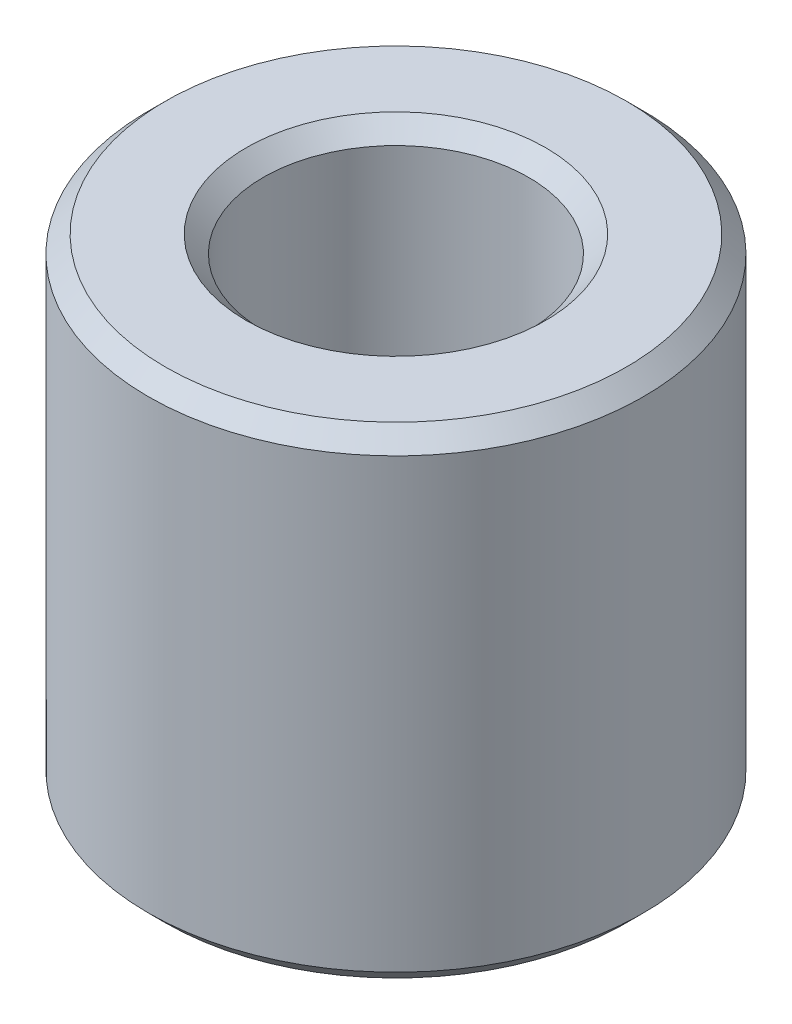
ISO-10303-21;
HEADER;
FILE_DESCRIPTION(('STEP AP214'),'2;1');
FILE_NAME('part.step','',(''),(''),'','','');
FILE_SCHEMA(('AUTOMOTIVE_DESIGN { 1 0 10303 214 1 1 1 1 }'));
ENDSEC;
DATA;
#1=APPLICATION_CONTEXT('core data for automotive mechanical design processes');
#2=APPLICATION_PROTOCOL_DEFINITION('international standard','automotive_design',2000,#1);
#3=PRODUCT_CONTEXT('',#1,'mechanical');
#4=PRODUCT('Part','Part','',(#3));
#5=PRODUCT_RELATED_PRODUCT_CATEGORY('part','',(#4));
#6=PRODUCT_DEFINITION_FORMATION('','',#4);
#7=PRODUCT_DEFINITION_CONTEXT('part definition',#1,'design');
#8=PRODUCT_DEFINITION('design','',#6,#7);
#9=PRODUCT_DEFINITION_SHAPE('','',#8);
#10=(LENGTH_UNIT() NAMED_UNIT(*) SI_UNIT(.MILLI.,.METRE.));
#11=(NAMED_UNIT(*) PLANE_ANGLE_UNIT() SI_UNIT($,.RADIAN.));
#12=(NAMED_UNIT(*) SI_UNIT($,.STERADIAN.) SOLID_ANGLE_UNIT());
#13=UNCERTAINTY_MEASURE_WITH_UNIT(LENGTH_MEASURE(1.E-05),#10,'distance_accuracy_value','');
#14=(GEOMETRIC_REPRESENTATION_CONTEXT(3) GLOBAL_UNCERTAINTY_ASSIGNED_CONTEXT((#13)) GLOBAL_UNIT_ASSIGNED_CONTEXT((#10,
#11,#12)) REPRESENTATION_CONTEXT('',''));
#15=CARTESIAN_POINT('',(0.,0.,0.));
#16=DIRECTION('',(0.,0.,1.));
#17=DIRECTION('',(1.,0.,0.));
#18=AXIS2_PLACEMENT_3D('',#15,#16,#17);
#19=CARTESIAN_POINT('',(0.,97.2382826836698,0.));
#20=DIRECTION('',(0.,-1.,0.));
#21=DIRECTION('',(0.,0.,-1.));
#22=AXIS2_PLACEMENT_3D('',#19,#20,#21);
#23=CYLINDRICAL_SURFACE('',#22,50.);
#24=CARTESIAN_POINT('',(0.,3.45333192184835,0.));
#25=DIRECTION('',(0.,1.,0.));
#26=DIRECTION('',(0.,0.,1.));
#27=AXIS2_PLACEMENT_3D('',#24,#25,#26);
#28=CIRCLE('',#27,50.);
#29=CARTESIAN_POINT('',(0.,3.45333192184835,50.));
#30=VERTEX_POINT('',#29);
#31=EDGE_CURVE('E10',#30,#30,#28,.T.);
#32=ORIENTED_EDGE('',*,*,#31,.T.);
#33=EDGE_LOOP('',(#32));
#34=FACE_BOUND('',#33,.T.);
#35=CARTESIAN_POINT('',(0.,93.7849507618214,0.));
#36=DIRECTION('',(0.,1.,0.));
#37=DIRECTION('',(0.,0.,1.));
#38=AXIS2_PLACEMENT_3D('',#35,#36,#37);
#39=CIRCLE('',#38,50.);
#40=CARTESIAN_POINT('',(0.,93.7849507618214,50.));
#41=VERTEX_POINT('',#40);
#42=EDGE_CURVE('E50',#41,#41,#39,.F.);
#43=ORIENTED_EDGE('',*,*,#42,.T.);
#44=EDGE_LOOP('',(#43));
#45=FACE_BOUND('',#44,.T.);
#46=ADVANCED_FACE('F39',(#34,#45),#23,.T.);
#47=CARTESIAN_POINT('',(0.,97.2382826836698,0.));
#48=DIRECTION('',(0.,1.,0.));
#49=DIRECTION('',(0.,0.,1.));
#50=AXIS2_PLACEMENT_3D('',#47,#48,#49);
#51=PLANE('',#50);
#52=CARTESIAN_POINT('',(0.,97.2382826836698,0.));
#53=DIRECTION('',(0.,1.,0.));
#54=DIRECTION('',(0.,0.,1.));
#55=AXIS2_PLACEMENT_3D('',#52,#53,#54);
#56=CIRCLE('',#55,30.2476286269089);
#57=CARTESIAN_POINT('',(0.,97.2382826836698,30.2476286269089));
#58=VERTEX_POINT('',#57);
#59=EDGE_CURVE('E58',#58,#58,#56,.F.);
#60=ORIENTED_EDGE('',*,*,#59,.T.);
#61=EDGE_LOOP('',(#60));
#62=FACE_BOUND('',#61,.T.);
#63=CARTESIAN_POINT('',(0.,97.2382826836698,0.));
#64=DIRECTION('',(0.,1.,0.));
#65=DIRECTION('',(0.,0.,1.));
#66=AXIS2_PLACEMENT_3D('',#63,#64,#65);
#67=CIRCLE('',#66,46.5466680781516);
#68=CARTESIAN_POINT('',(0.,97.2382826836698,46.5466680781516));
#69=VERTEX_POINT('',#68);
#70=EDGE_CURVE('E61',#69,#69,#67,.T.);
#71=ORIENTED_EDGE('',*,*,#70,.T.);
#72=EDGE_LOOP('',(#71));
#73=FACE_BOUND('',#72,.T.);
#74=ADVANCED_FACE('F88',(#62,#73),#51,.T.);
#75=CARTESIAN_POINT('',(0.,0.,0.));
#76=DIRECTION('',(0.,1.,0.));
#77=DIRECTION('',(0.,0.,1.));
#78=AXIS2_PLACEMENT_3D('',#75,#76,#77);
#79=PLANE('',#78);
#80=CARTESIAN_POINT('',(0.,0.,0.));
#81=DIRECTION('',(0.,1.,0.));
#82=DIRECTION('',(0.,0.,1.));
#83=AXIS2_PLACEMENT_3D('',#80,#81,#82);
#84=CIRCLE('',#83,30.2476286269089);
#85=CARTESIAN_POINT('',(0.,0.,30.2476286269089));
#86=VERTEX_POINT('',#85);
#87=EDGE_CURVE('E51',#86,#86,#84,.T.);
#88=ORIENTED_EDGE('',*,*,#87,.T.);
#89=EDGE_LOOP('',(#88));
#90=FACE_BOUND('',#89,.T.);
#91=CARTESIAN_POINT('',(0.,0.,0.));
#92=DIRECTION('',(0.,1.,0.));
#93=DIRECTION('',(0.,0.,1.));
#94=AXIS2_PLACEMENT_3D('',#91,#92,#93);
#95=CIRCLE('',#94,46.5466680781516);
#96=CARTESIAN_POINT('',(0.,0.,46.5466680781516));
#97=VERTEX_POINT('',#96);
#98=EDGE_CURVE('E54',#97,#97,#95,.F.);
#99=ORIENTED_EDGE('',*,*,#98,.T.);
#100=EDGE_LOOP('',(#99));
#101=FACE_BOUND('',#100,.T.);
#102=ADVANCED_FACE('F83',(#90,#101),#79,.F.);
#103=CARTESIAN_POINT('',(0.,97.2382826836698,0.));
#104=DIRECTION('',(0.,-1.,0.));
#105=DIRECTION('',(0.,0.,-1.));
#106=AXIS2_PLACEMENT_3D('',#103,#104,#105);
#107=CYLINDRICAL_SURFACE('',#106,26.7942967050605);
#108=CARTESIAN_POINT('',(0.,93.7849507618214,0.));
#109=DIRECTION('',(0.,1.,0.));
#110=DIRECTION('',(0.,0.,1.));
#111=AXIS2_PLACEMENT_3D('',#108,#109,#110);
#112=CIRCLE('',#111,26.7942967050605);
#113=CARTESIAN_POINT('',(0.,93.7849507618214,26.7942967050605));
#114=VERTEX_POINT('',#113);
#115=EDGE_CURVE('E67',#114,#114,#112,.T.);
#116=ORIENTED_EDGE('',*,*,#115,.T.);
#117=EDGE_LOOP('',(#116));
#118=FACE_BOUND('',#117,.T.);
#119=CARTESIAN_POINT('',(0.,3.45333192184835,0.));
#120=DIRECTION('',(0.,1.,0.));
#121=DIRECTION('',(0.,0.,1.));
#122=AXIS2_PLACEMENT_3D('',#119,#120,#121);
#123=CIRCLE('',#122,26.7942967050605);
#124=CARTESIAN_POINT('',(0.,3.45333192184835,26.7942967050605));
#125=VERTEX_POINT('',#124);
#126=EDGE_CURVE('E69',#125,#125,#123,.F.);
#127=ORIENTED_EDGE('',*,*,#126,.T.);
#128=EDGE_LOOP('',(#127));
#129=FACE_BOUND('',#128,.T.);
#130=ADVANCED_FACE('F71',(#118,#129),#107,.F.);
#131=CARTESIAN_POINT('',(0.,93.7849507618214,0.));
#132=DIRECTION('',(0.,1.,0.));
#133=DIRECTION('',(0.,0.,1.));
#134=AXIS2_PLACEMENT_3D('',#131,#132,#133);
#135=CONICAL_SURFACE('',#134,26.7942967050605,0.785398163397453);
#136=ORIENTED_EDGE('',*,*,#59,.F.);
#137=EDGE_LOOP('',(#136));
#138=FACE_BOUND('',#137,.T.);
#139=ORIENTED_EDGE('',*,*,#115,.F.);
#140=EDGE_LOOP('',(#139));
#141=FACE_BOUND('',#140,.T.);
#142=ADVANCED_FACE('F77',(#138,#141),#135,.F.);
#143=CARTESIAN_POINT('',(0.,0.,0.));
#144=DIRECTION('',(0.,-1.,0.));
#145=DIRECTION('',(0.,0.,-1.));
#146=AXIS2_PLACEMENT_3D('',#143,#144,#145);
#147=CONICAL_SURFACE('',#146,30.2476286269089,0.785398163397447);
#148=ORIENTED_EDGE('',*,*,#126,.F.);
#149=EDGE_LOOP('',(#148));
#150=FACE_BOUND('',#149,.T.);
#151=ORIENTED_EDGE('',*,*,#87,.F.);
#152=EDGE_LOOP('',(#151));
#153=FACE_BOUND('',#152,.T.);
#154=ADVANCED_FACE('F73',(#150,#153),#147,.F.);
#155=CARTESIAN_POINT('',(0.,3.45333192184835,0.));
#156=DIRECTION('',(0.,1.,0.));
#157=DIRECTION('',(0.,0.,1.));
#158=AXIS2_PLACEMENT_3D('',#155,#156,#157);
#159=CONICAL_SURFACE('',#158,50.,0.785398163397449);
#160=ORIENTED_EDGE('',*,*,#98,.F.);
#161=EDGE_LOOP('',(#160));
#162=FACE_BOUND('',#161,.T.);
#163=ORIENTED_EDGE('',*,*,#31,.F.);
#164=EDGE_LOOP('',(#163));
#165=FACE_BOUND('',#164,.T.);
#166=ADVANCED_FACE('F76',(#162,#165),#159,.T.);
#167=CARTESIAN_POINT('',(0.,97.2382826836698,0.));
#168=DIRECTION('',(0.,-1.,0.));
#169=DIRECTION('',(0.,0.,-1.));
#170=AXIS2_PLACEMENT_3D('',#167,#168,#169);
#171=CONICAL_SURFACE('',#170,46.5466680781516,0.78539816339745);
#172=ORIENTED_EDGE('',*,*,#42,.F.);
#173=EDGE_LOOP('',(#172));
#174=FACE_BOUND('',#173,.T.);
#175=ORIENTED_EDGE('',*,*,#70,.F.);
#176=EDGE_LOOP('',(#175));
#177=FACE_BOUND('',#176,.T.);
#178=ADVANCED_FACE('F45',(#174,#177),#171,.T.);
#179=CLOSED_SHELL('',(#46,#74,#102,#130,#142,#154,#166,#178));
#180=MANIFOLD_SOLID_BREP('B2',#179);
#181=ADVANCED_BREP_SHAPE_REPRESENTATION('',(#18,#180),#14);
#182=SHAPE_DEFINITION_REPRESENTATION(#9,#181);
ENDSEC;
END-ISO-10303-21;
